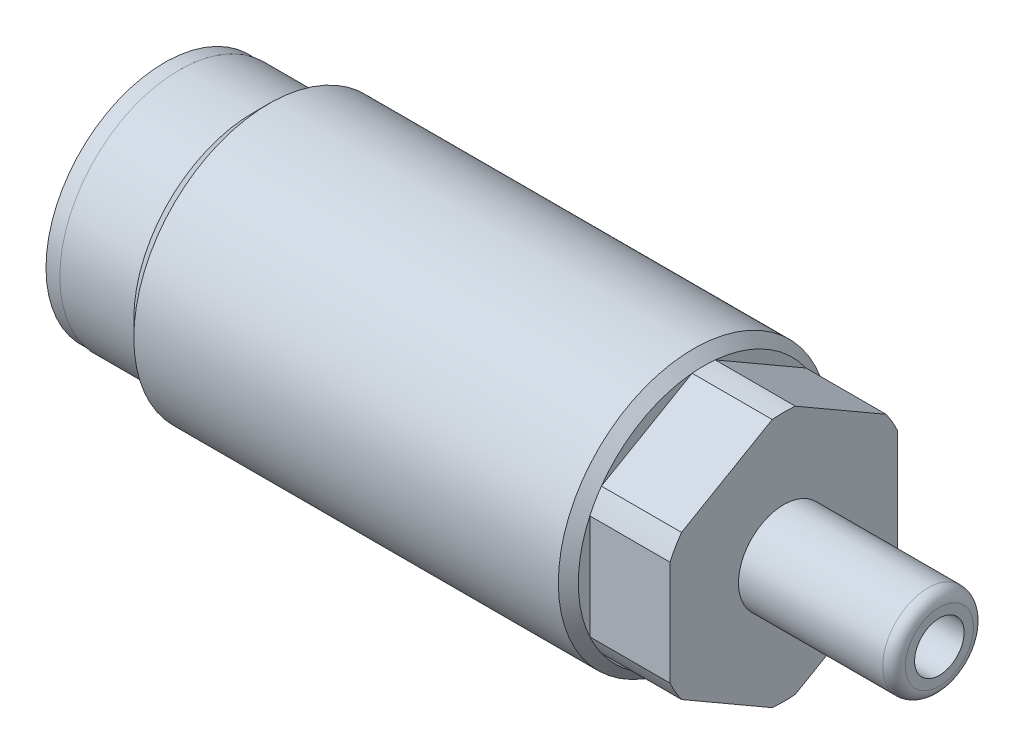
ISO-10303-21;
HEADER;
FILE_DESCRIPTION(('STEP AP214'),'2;1');
FILE_NAME('part.step','',(''),(''),'','','');
FILE_SCHEMA(('AUTOMOTIVE_DESIGN { 1 0 10303 214 1 1 1 1 }'));
ENDSEC;
DATA;
#1=APPLICATION_CONTEXT('core data for automotive mechanical design processes');
#2=APPLICATION_PROTOCOL_DEFINITION('international standard','automotive_design',2000,#1);
#3=PRODUCT_CONTEXT('',#1,'mechanical');
#4=PRODUCT('Part','Part','',(#3));
#5=PRODUCT_RELATED_PRODUCT_CATEGORY('part','',(#4));
#6=PRODUCT_DEFINITION_FORMATION('','',#4);
#7=PRODUCT_DEFINITION_CONTEXT('part definition',#1,'design');
#8=PRODUCT_DEFINITION('design','',#6,#7);
#9=PRODUCT_DEFINITION_SHAPE('','',#8);
#10=(LENGTH_UNIT() NAMED_UNIT(*) SI_UNIT(.MILLI.,.METRE.));
#11=(NAMED_UNIT(*) PLANE_ANGLE_UNIT() SI_UNIT($,.RADIAN.));
#12=(NAMED_UNIT(*) SI_UNIT($,.STERADIAN.) SOLID_ANGLE_UNIT());
#13=UNCERTAINTY_MEASURE_WITH_UNIT(LENGTH_MEASURE(1.E-05),#10,'distance_accuracy_value','');
#14=(GEOMETRIC_REPRESENTATION_CONTEXT(3) GLOBAL_UNCERTAINTY_ASSIGNED_CONTEXT((#13)) GLOBAL_UNIT_ASSIGNED_CONTEXT((#10,
#11,#12)) REPRESENTATION_CONTEXT('',''));
#15=CARTESIAN_POINT('',(0.,0.,0.));
#16=DIRECTION('',(0.,0.,1.));
#17=DIRECTION('',(1.,0.,0.));
#18=AXIS2_PLACEMENT_3D('',#15,#16,#17);
#19=CARTESIAN_POINT('',(0.,0.,0.));
#20=DIRECTION('',(1.,0.,0.));
#21=DIRECTION('',(0.,0.,-1.));
#22=AXIS2_PLACEMENT_3D('',#19,#20,#21);
#23=PLANE('',#22);
#24=CARTESIAN_POINT('',(0.,0.,0.));
#25=DIRECTION('',(-1.,0.,0.));
#26=DIRECTION('',(0.,0.,1.));
#27=AXIS2_PLACEMENT_3D('',#24,#25,#26);
#28=CIRCLE('',#27,8.3185);
#29=CARTESIAN_POINT('',(0.,0.,8.3185));
#30=VERTEX_POINT('',#29);
#31=EDGE_CURVE('E235',#30,#30,#28,.T.);
#32=ORIENTED_EDGE('',*,*,#31,.T.);
#33=EDGE_LOOP('',(#32));
#34=FACE_BOUND('',#33,.T.);
#35=CARTESIAN_POINT('',(0.,0.,0.));
#36=DIRECTION('',(1.,0.,0.));
#37=DIRECTION('',(0.,0.,-1.));
#38=AXIS2_PLACEMENT_3D('',#35,#36,#37);
#39=CIRCLE('',#38,8.2677);
#40=CARTESIAN_POINT('',(0.,0.,-8.2677));
#41=VERTEX_POINT('',#40);
#42=EDGE_CURVE('E48',#41,#41,#39,.F.);
#43=ORIENTED_EDGE('',*,*,#42,.F.);
#44=EDGE_LOOP('',(#43));
#45=FACE_BOUND('',#44,.T.);
#46=ADVANCED_FACE('F40',(#34,#45),#23,.F.);
#47=CARTESIAN_POINT('',(42.164,0.,0.));
#48=DIRECTION('',(-1.,0.,0.));
#49=DIRECTION('',(0.,0.,1.));
#50=AXIS2_PLACEMENT_3D('',#47,#48,#49);
#51=PLANE('',#50);
#52=CARTESIAN_POINT('',(42.164,0.,0.));
#53=DIRECTION('',(-1.,0.,0.));
#54=DIRECTION('',(0.,0.,1.));
#55=AXIS2_PLACEMENT_3D('',#52,#53,#54);
#56=CIRCLE('',#55,8.7376);
#57=CARTESIAN_POINT('',(42.164,-5.04775879575,7.13202530140833));
#58=VERTEX_POINT('',#57);
#59=CARTESIAN_POINT('',(42.164,-3.652635693578,7.9375));
#60=VERTEX_POINT('',#59);
#61=EDGE_CURVE('E223',#58,#60,#56,.T.);
#62=ORIENTED_EDGE('',*,*,#61,.F.);
#63=DIRECTION('',(0.,0.499999999999998,0.86602540378444));
#64=VECTOR('',#63,1.);
#65=CARTESIAN_POINT('',(42.164,-6.87407664253899,3.96874999999998));
#66=LINE('',#65,#64);
#67=CARTESIAN_POINT('',(42.164,-8.70039448932799,0.805474698591639));
#68=VERTEX_POINT('',#67);
#69=EDGE_CURVE('E139',#68,#58,#66,.T.);
#70=ORIENTED_EDGE('',*,*,#69,.F.);
#71=CARTESIAN_POINT('',(42.164,-8.70039448932798,-0.805474698591645));
#72=VERTEX_POINT('',#71);
#73=EDGE_CURVE('E421',#72,#68,#56,.T.);
#74=ORIENTED_EDGE('',*,*,#73,.F.);
#75=DIRECTION('',(0.,0.499999999999998,-0.86602540378444));
#76=VECTOR('',#75,1.);
#77=CARTESIAN_POINT('',(42.164,-6.87407664253899,-3.96874999999999));
#78=LINE('',#77,#76);
#79=CARTESIAN_POINT('',(42.164,-5.04775879575,-7.13202530140833));
#80=VERTEX_POINT('',#79);
#81=EDGE_CURVE('E155',#72,#80,#78,.T.);
#82=ORIENTED_EDGE('',*,*,#81,.T.);
#83=CARTESIAN_POINT('',(42.164,-3.65263569357799,-7.9375));
#84=VERTEX_POINT('',#83);
#85=EDGE_CURVE('E423',#84,#80,#56,.T.);
#86=ORIENTED_EDGE('',*,*,#85,.F.);
#87=DIRECTION('',(0.,-1.,0.));
#88=VECTOR('',#87,1.);
#89=CARTESIAN_POINT('',(42.164,0.,-7.9375));
#90=LINE('',#89,#88);
#91=CARTESIAN_POINT('',(42.164,3.652635693578,-7.9375));
#92=VERTEX_POINT('',#91);
#93=EDGE_CURVE('E165',#92,#84,#90,.T.);
#94=ORIENTED_EDGE('',*,*,#93,.F.);
#95=CARTESIAN_POINT('',(42.164,5.04775879575001,-7.13202530140832));
#96=VERTEX_POINT('',#95);
#97=EDGE_CURVE('E428',#96,#92,#56,.T.);
#98=ORIENTED_EDGE('',*,*,#97,.F.);
#99=DIRECTION('',(0.,-0.499999999999998,-0.86602540378444));
#100=VECTOR('',#99,1.);
#101=CARTESIAN_POINT('',(42.164,6.87407664253899,-3.96874999999998));
#102=LINE('',#101,#100);
#103=CARTESIAN_POINT('',(42.164,8.70039448932798,-0.805474698591648));
#104=VERTEX_POINT('',#103);
#105=EDGE_CURVE('E177',#104,#96,#102,.T.);
#106=ORIENTED_EDGE('',*,*,#105,.F.);
#107=CARTESIAN_POINT('',(42.164,8.70039448932798,0.805474698591648));
#108=VERTEX_POINT('',#107);
#109=EDGE_CURVE('E229',#108,#104,#56,.T.);
#110=ORIENTED_EDGE('',*,*,#109,.F.);
#111=DIRECTION('',(0.,-0.499999999999998,0.86602540378444));
#112=VECTOR('',#111,1.);
#113=CARTESIAN_POINT('',(42.164,6.87407664253899,3.96874999999998));
#114=LINE('',#113,#112);
#115=CARTESIAN_POINT('',(42.164,5.04775879575001,7.13202530140832));
#116=VERTEX_POINT('',#115);
#117=EDGE_CURVE('E188',#108,#116,#114,.T.);
#118=ORIENTED_EDGE('',*,*,#117,.T.);
#119=CARTESIAN_POINT('',(42.164,3.652635693578,7.9375));
#120=VERTEX_POINT('',#119);
#121=EDGE_CURVE('E225',#120,#116,#56,.T.);
#122=ORIENTED_EDGE('',*,*,#121,.F.);
#123=DIRECTION('',(0.,1.,0.));
#124=VECTOR('',#123,1.);
#125=CARTESIAN_POINT('',(42.164,0.,7.9375));
#126=LINE('',#125,#124);
#127=EDGE_CURVE('E200',#60,#120,#126,.T.);
#128=ORIENTED_EDGE('',*,*,#127,.F.);
#129=EDGE_LOOP('',(#62,#70,#74,#82,#86,#94,#98,#106,#110,#118,#122,#128));
#130=FACE_BOUND('',#129,.T.);
#131=CARTESIAN_POINT('',(42.164,0.,0.));
#132=DIRECTION('',(-1.,0.,0.));
#133=DIRECTION('',(0.,0.,1.));
#134=AXIS2_PLACEMENT_3D('',#131,#132,#133);
#135=CIRCLE('',#134,3.1623);
#136=CARTESIAN_POINT('',(42.164,0.,3.1623));
#137=VERTEX_POINT('',#136);
#138=EDGE_CURVE('E244',#137,#137,#135,.F.);
#139=ORIENTED_EDGE('',*,*,#138,.F.);
#140=EDGE_LOOP('',(#139));
#141=FACE_BOUND('',#140,.T.);
#142=ADVANCED_FACE('F258',(#130,#141),#51,.F.);
#143=CARTESIAN_POINT('',(-3.32735081986688,0.,0.));
#144=DIRECTION('',(-1.,0.,0.));
#145=DIRECTION('',(0.,0.,1.));
#146=AXIS2_PLACEMENT_3D('',#143,#144,#145);
#147=CYLINDRICAL_SURFACE('',#146,8.7376);
#148=DIRECTION('',(1.,0.,0.));
#149=VECTOR('',#148,1.);
#150=CARTESIAN_POINT('',(36.576,-8.70039448932799,0.805474698591639));
#151=LINE('',#150,#149);
#152=CARTESIAN_POINT('',(36.576,-8.70039448932799,0.805474698591639));
#153=VERTEX_POINT('',#152);
#154=EDGE_CURVE('E150',#153,#68,#151,.T.);
#155=ORIENTED_EDGE('',*,*,#154,.F.);
#156=CARTESIAN_POINT('',(36.576,0.,0.));
#157=DIRECTION('',(-1.,0.,0.));
#158=DIRECTION('',(0.,0.,1.));
#159=AXIS2_PLACEMENT_3D('',#156,#157,#158);
#160=CIRCLE('',#159,8.7376);
#161=CARTESIAN_POINT('',(36.576,-8.70039448932798,-0.805474698591632));
#162=VERTEX_POINT('',#161);
#163=EDGE_CURVE('E447',#162,#153,#160,.T.);
#164=ORIENTED_EDGE('',*,*,#163,.F.);
#165=DIRECTION('',(1.,0.,0.));
#166=VECTOR('',#165,1.);
#167=CARTESIAN_POINT('',(36.576,-8.70039448932798,-0.805474698591645));
#168=LINE('',#167,#166);
#169=EDGE_CURVE('E160',#162,#72,#168,.T.);
#170=ORIENTED_EDGE('',*,*,#169,.T.);
#171=ORIENTED_EDGE('',*,*,#73,.T.);
#172=EDGE_LOOP('',(#155,#164,#170,#171));
#173=FACE_BOUND('',#172,.T.);
#174=ADVANCED_FACE('F264',(#173),#147,.T.);
#175=DIRECTION('',(1.,0.,0.));
#176=VECTOR('',#175,1.);
#177=CARTESIAN_POINT('',(36.576,-5.04775879575,7.13202530140833));
#178=LINE('',#177,#176);
#179=CARTESIAN_POINT('',(36.576,-5.04775879575,7.13202530140832));
#180=VERTEX_POINT('',#179);
#181=EDGE_CURVE('E152',#180,#58,#178,.T.);
#182=ORIENTED_EDGE('',*,*,#181,.T.);
#183=ORIENTED_EDGE('',*,*,#61,.T.);
#184=DIRECTION('',(1.,0.,0.));
#185=VECTOR('',#184,1.);
#186=CARTESIAN_POINT('',(36.576,-3.652635693578,7.9375));
#187=LINE('',#186,#185);
#188=CARTESIAN_POINT('',(36.576,-3.652635693578,7.9375));
#189=VERTEX_POINT('',#188);
#190=EDGE_CURVE('E209',#189,#60,#187,.T.);
#191=ORIENTED_EDGE('',*,*,#190,.F.);
#192=EDGE_CURVE('E219',#180,#189,#160,.T.);
#193=ORIENTED_EDGE('',*,*,#192,.F.);
#194=EDGE_LOOP('',(#182,#183,#191,#193));
#195=FACE_BOUND('',#194,.T.);
#196=ADVANCED_FACE('F366',(#195),#147,.T.);
#197=ORIENTED_EDGE('',*,*,#85,.T.);
#198=DIRECTION('',(1.,0.,0.));
#199=VECTOR('',#198,1.);
#200=CARTESIAN_POINT('',(36.576,-5.04775879575,-7.13202530140833));
#201=LINE('',#200,#199);
#202=CARTESIAN_POINT('',(36.576,-5.04775879575,-7.13202530140833));
#203=VERTEX_POINT('',#202);
#204=EDGE_CURVE('E163',#203,#80,#201,.T.);
#205=ORIENTED_EDGE('',*,*,#204,.F.);
#206=CARTESIAN_POINT('',(36.576,-3.65263569357799,-7.9375));
#207=VERTEX_POINT('',#206);
#208=EDGE_CURVE('E444',#207,#203,#160,.T.);
#209=ORIENTED_EDGE('',*,*,#208,.F.);
#210=DIRECTION('',(1.,0.,0.));
#211=VECTOR('',#210,1.);
#212=CARTESIAN_POINT('',(36.576,-3.65263569357799,-7.9375));
#213=LINE('',#212,#211);
#214=EDGE_CURVE('E174',#207,#84,#213,.T.);
#215=ORIENTED_EDGE('',*,*,#214,.T.);
#216=EDGE_LOOP('',(#197,#205,#209,#215));
#217=FACE_BOUND('',#216,.T.);
#218=ADVANCED_FACE('F369',(#217),#147,.T.);
#219=DIRECTION('',(1.,0.,0.));
#220=VECTOR('',#219,1.);
#221=CARTESIAN_POINT('',(36.576,3.652635693578,-7.9375));
#222=LINE('',#221,#220);
#223=CARTESIAN_POINT('',(36.576,3.652635693578,-7.9375));
#224=VERTEX_POINT('',#223);
#225=EDGE_CURVE('E172',#224,#92,#222,.T.);
#226=ORIENTED_EDGE('',*,*,#225,.F.);
#227=CARTESIAN_POINT('',(36.576,5.04775879575001,-7.13202530140832));
#228=VERTEX_POINT('',#227);
#229=EDGE_CURVE('E414',#228,#224,#160,.T.);
#230=ORIENTED_EDGE('',*,*,#229,.F.);
#231=DIRECTION('',(1.,0.,0.));
#232=VECTOR('',#231,1.);
#233=CARTESIAN_POINT('',(36.576,5.04775879575001,-7.13202530140832));
#234=LINE('',#233,#232);
#235=EDGE_CURVE('E185',#228,#96,#234,.T.);
#236=ORIENTED_EDGE('',*,*,#235,.T.);
#237=ORIENTED_EDGE('',*,*,#97,.T.);
#238=EDGE_LOOP('',(#226,#230,#236,#237));
#239=FACE_BOUND('',#238,.T.);
#240=ADVANCED_FACE('F397',(#239),#147,.T.);
#241=DIRECTION('',(1.,0.,0.));
#242=VECTOR('',#241,1.);
#243=CARTESIAN_POINT('',(36.576,8.70039448932798,-0.805474698591648));
#244=LINE('',#243,#242);
#245=CARTESIAN_POINT('',(36.576,8.70039448932798,-0.805474698591648));
#246=VERTEX_POINT('',#245);
#247=EDGE_CURVE('E183',#246,#104,#244,.T.);
#248=ORIENTED_EDGE('',*,*,#247,.F.);
#249=CARTESIAN_POINT('',(36.576,8.70039448932798,0.805474698591648));
#250=VERTEX_POINT('',#249);
#251=EDGE_CURVE('E224',#250,#246,#160,.T.);
#252=ORIENTED_EDGE('',*,*,#251,.F.);
#253=DIRECTION('',(1.,0.,0.));
#254=VECTOR('',#253,1.);
#255=CARTESIAN_POINT('',(36.576,8.70039448932798,0.805474698591648));
#256=LINE('',#255,#254);
#257=EDGE_CURVE('E195',#250,#108,#256,.T.);
#258=ORIENTED_EDGE('',*,*,#257,.T.);
#259=ORIENTED_EDGE('',*,*,#109,.T.);
#260=EDGE_LOOP('',(#248,#252,#258,#259));
#261=FACE_BOUND('',#260,.T.);
#262=ADVANCED_FACE('F384',(#261),#147,.T.);
#263=ORIENTED_EDGE('',*,*,#121,.T.);
#264=DIRECTION('',(1.,0.,0.));
#265=VECTOR('',#264,1.);
#266=CARTESIAN_POINT('',(36.576,5.04775879575001,7.13202530140832));
#267=LINE('',#266,#265);
#268=CARTESIAN_POINT('',(36.576,5.04775879575001,7.13202530140832));
#269=VERTEX_POINT('',#268);
#270=EDGE_CURVE('E198',#269,#116,#267,.T.);
#271=ORIENTED_EDGE('',*,*,#270,.F.);
#272=CARTESIAN_POINT('',(36.576,3.652635693578,7.9375));
#273=VERTEX_POINT('',#272);
#274=EDGE_CURVE('E220',#273,#269,#160,.T.);
#275=ORIENTED_EDGE('',*,*,#274,.F.);
#276=DIRECTION('',(1.,0.,0.));
#277=VECTOR('',#276,1.);
#278=CARTESIAN_POINT('',(36.576,3.652635693578,7.9375));
#279=LINE('',#278,#277);
#280=EDGE_CURVE('E211',#273,#120,#279,.T.);
#281=ORIENTED_EDGE('',*,*,#280,.T.);
#282=EDGE_LOOP('',(#263,#271,#275,#281));
#283=FACE_BOUND('',#282,.T.);
#284=ADVANCED_FACE('F371',(#283),#147,.T.);
#285=CARTESIAN_POINT('',(-25.954653294511,0.,0.));
#286=DIRECTION('',(-1.,0.,0.));
#287=DIRECTION('',(0.,0.,1.));
#288=AXIS2_PLACEMENT_3D('',#285,#286,#287);
#289=CYLINDRICAL_SURFACE('',#288,9.4361);
#290=CARTESIAN_POINT('',(6.27380000000001,0.,0.));
#291=DIRECTION('',(-1.,0.,0.));
#292=DIRECTION('',(0.,0.,1.));
#293=AXIS2_PLACEMENT_3D('',#290,#291,#292);
#294=CIRCLE('',#293,9.4361);
#295=CARTESIAN_POINT('',(6.27380000000001,0.,9.4361));
#296=VERTEX_POINT('',#295);
#297=EDGE_CURVE('E228',#296,#296,#294,.T.);
#298=ORIENTED_EDGE('',*,*,#297,.F.);
#299=EDGE_LOOP('',(#298));
#300=FACE_BOUND('',#299,.T.);
#301=CARTESIAN_POINT('',(35.8775,0.,0.));
#302=DIRECTION('',(-1.,0.,0.));
#303=DIRECTION('',(0.,0.,1.));
#304=AXIS2_PLACEMENT_3D('',#301,#302,#303);
#305=CIRCLE('',#304,9.4361);
#306=CARTESIAN_POINT('',(35.8775,0.,9.4361));
#307=VERTEX_POINT('',#306);
#308=EDGE_CURVE('E214',#307,#307,#305,.T.);
#309=ORIENTED_EDGE('',*,*,#308,.T.);
#310=EDGE_LOOP('',(#309));
#311=FACE_BOUND('',#310,.T.);
#312=ADVANCED_FACE('F377',(#300,#311),#289,.T.);
#313=CARTESIAN_POINT('',(-2.14655754787169,0.,0.));
#314=DIRECTION('',(-1.,0.,0.));
#315=DIRECTION('',(0.,0.,1.));
#316=AXIS2_PLACEMENT_3D('',#313,#314,#315);
#317=CYLINDRICAL_SURFACE('',#316,8.3185);
#318=CARTESIAN_POINT('',(5.1562,0.,0.));
#319=DIRECTION('',(-1.,0.,0.));
#320=DIRECTION('',(0.,0.,1.));
#321=AXIS2_PLACEMENT_3D('',#318,#319,#320);
#322=CIRCLE('',#321,8.3185);
#323=CARTESIAN_POINT('',(5.1562,0.,8.3185));
#324=VERTEX_POINT('',#323);
#325=EDGE_CURVE('E232',#324,#324,#322,.T.);
#326=ORIENTED_EDGE('',*,*,#325,.T.);
#327=EDGE_LOOP('',(#326));
#328=FACE_BOUND('',#327,.T.);
#329=ORIENTED_EDGE('',*,*,#31,.F.);
#330=EDGE_LOOP('',(#329));
#331=FACE_BOUND('',#330,.T.);
#332=ADVANCED_FACE('F374',(#328,#331),#317,.T.);
#333=CARTESIAN_POINT('',(5.1562,0.,0.));
#334=DIRECTION('',(1.,0.,0.));
#335=DIRECTION('',(0.,0.,-1.));
#336=AXIS2_PLACEMENT_3D('',#333,#334,#335);
#337=CONICAL_SURFACE('',#336,8.3185,0.785398163397443);
#338=ORIENTED_EDGE('',*,*,#297,.T.);
#339=EDGE_LOOP('',(#338));
#340=FACE_BOUND('',#339,.T.);
#341=ORIENTED_EDGE('',*,*,#325,.F.);
#342=EDGE_LOOP('',(#341));
#343=FACE_BOUND('',#342,.T.);
#344=ADVANCED_FACE('F364',(#340,#343),#337,.T.);
#345=CARTESIAN_POINT('',(35.8775,0.,0.));
#346=DIRECTION('',(-1.,0.,0.));
#347=DIRECTION('',(0.,0.,1.));
#348=AXIS2_PLACEMENT_3D('',#345,#346,#347);
#349=CONICAL_SURFACE('',#348,9.4361,0.785398163397445);
#350=ORIENTED_EDGE('',*,*,#274,.T.);
#351=CARTESIAN_POINT('',(36.576,0.,0.));
#352=DIRECTION('',(1.,0.,0.));
#353=DIRECTION('',(0.,0.,-1.));
#354=AXIS2_PLACEMENT_3D('',#351,#352,#353);
#355=CIRCLE('',#354,8.7376);
#356=EDGE_CURVE('E192',#250,#269,#355,.T.);
#357=ORIENTED_EDGE('',*,*,#356,.F.);
#358=ORIENTED_EDGE('',*,*,#251,.T.);
#359=CARTESIAN_POINT('',(36.576,0.,0.));
#360=DIRECTION('',(1.,0.,0.));
#361=DIRECTION('',(0.,0.,-1.));
#362=AXIS2_PLACEMENT_3D('',#359,#360,#361);
#363=CIRCLE('',#362,8.7376);
#364=EDGE_CURVE('E179',#228,#246,#363,.T.);
#365=ORIENTED_EDGE('',*,*,#364,.F.);
#366=ORIENTED_EDGE('',*,*,#229,.T.);
#367=CARTESIAN_POINT('',(36.576,0.,0.));
#368=DIRECTION('',(1.,0.,0.));
#369=DIRECTION('',(0.,0.,-1.));
#370=AXIS2_PLACEMENT_3D('',#367,#368,#369);
#371=CIRCLE('',#370,8.7376);
#372=EDGE_CURVE('E168',#207,#224,#371,.T.);
#373=ORIENTED_EDGE('',*,*,#372,.F.);
#374=ORIENTED_EDGE('',*,*,#208,.T.);
#375=CARTESIAN_POINT('',(36.576,0.,0.));
#376=DIRECTION('',(1.,0.,0.));
#377=DIRECTION('',(0.,0.,-1.));
#378=AXIS2_PLACEMENT_3D('',#375,#376,#377);
#379=CIRCLE('',#378,8.7376);
#380=EDGE_CURVE('E158',#162,#203,#379,.T.);
#381=ORIENTED_EDGE('',*,*,#380,.F.);
#382=ORIENTED_EDGE('',*,*,#163,.T.);
#383=CARTESIAN_POINT('',(36.576,0.,0.));
#384=DIRECTION('',(1.,0.,0.));
#385=DIRECTION('',(0.,0.,-1.));
#386=AXIS2_PLACEMENT_3D('',#383,#384,#385);
#387=CIRCLE('',#386,8.7376);
#388=EDGE_CURVE('E142',#180,#153,#387,.T.);
#389=ORIENTED_EDGE('',*,*,#388,.F.);
#390=ORIENTED_EDGE('',*,*,#192,.T.);
#391=CARTESIAN_POINT('',(36.576,0.,0.));
#392=DIRECTION('',(1.,0.,0.));
#393=DIRECTION('',(0.,0.,-1.));
#394=AXIS2_PLACEMENT_3D('',#391,#392,#393);
#395=CIRCLE('',#394,8.7376);
#396=EDGE_CURVE('E203',#273,#189,#395,.T.);
#397=ORIENTED_EDGE('',*,*,#396,.F.);
#398=EDGE_LOOP('',(#350,#357,#358,#365,#366,#373,#374,#381,#382,#389,#390,#397));
#399=FACE_BOUND('',#398,.T.);
#400=ORIENTED_EDGE('',*,*,#308,.F.);
#401=EDGE_LOOP('',(#400));
#402=FACE_BOUND('',#401,.T.);
#403=ADVANCED_FACE('F360',(#399,#402),#349,.T.);
#404=CARTESIAN_POINT('',(36.576,0.,7.9375));
#405=DIRECTION('',(0.,0.,-1.));
#406=DIRECTION('',(-1.,0.,0.));
#407=AXIS2_PLACEMENT_3D('',#404,#405,#406);
#408=PLANE('',#407);
#409=ORIENTED_EDGE('',*,*,#127,.T.);
#410=ORIENTED_EDGE('',*,*,#280,.F.);
#411=DIRECTION('',(0.,1.,0.));
#412=VECTOR('',#411,1.);
#413=CARTESIAN_POINT('',(36.576,0.,7.9375));
#414=LINE('',#413,#412);
#415=EDGE_CURVE('E206',#189,#273,#414,.T.);
#416=ORIENTED_EDGE('',*,*,#415,.F.);
#417=ORIENTED_EDGE('',*,*,#190,.T.);
#418=EDGE_LOOP('',(#409,#410,#416,#417));
#419=FACE_BOUND('',#418,.T.);
#420=ADVANCED_FACE('F356',(#419),#408,.F.);
#421=CARTESIAN_POINT('',(36.576,0.,0.));
#422=DIRECTION('',(1.,0.,0.));
#423=DIRECTION('',(0.,0.,-1.));
#424=AXIS2_PLACEMENT_3D('',#421,#422,#423);
#425=PLANE('',#424);
#426=ORIENTED_EDGE('',*,*,#396,.T.);
#427=ORIENTED_EDGE('',*,*,#415,.T.);
#428=EDGE_LOOP('',(#426,#427));
#429=FACE_BOUND('',#428,.T.);
#430=ADVANCED_FACE('F352',(#429),#425,.T.);
#431=CARTESIAN_POINT('',(36.576,6.87407664253899,3.96874999999998));
#432=DIRECTION('',(0.,0.86602540378444,0.499999999999998));
#433=DIRECTION('',(0.,-0.499999999999998,0.86602540378444));
#434=AXIS2_PLACEMENT_3D('',#431,#432,#433);
#435=PLANE('',#434);
#436=ORIENTED_EDGE('',*,*,#117,.F.);
#437=ORIENTED_EDGE('',*,*,#257,.F.);
#438=DIRECTION('',(0.,-0.499999999999998,0.86602540378444));
#439=VECTOR('',#438,1.);
#440=CARTESIAN_POINT('',(36.576,6.87407664253899,3.96874999999998));
#441=LINE('',#440,#439);
#442=EDGE_CURVE('E190',#250,#269,#441,.T.);
#443=ORIENTED_EDGE('',*,*,#442,.T.);
#444=ORIENTED_EDGE('',*,*,#270,.T.);
#445=EDGE_LOOP('',(#436,#437,#443,#444));
#446=FACE_BOUND('',#445,.T.);
#447=ADVANCED_FACE('F348',(#446),#435,.T.);
#448=CARTESIAN_POINT('',(36.576,0.,0.));
#449=DIRECTION('',(1.,0.,0.));
#450=DIRECTION('',(0.,0.,-1.));
#451=AXIS2_PLACEMENT_3D('',#448,#449,#450);
#452=PLANE('',#451);
#453=ORIENTED_EDGE('',*,*,#442,.F.);
#454=ORIENTED_EDGE('',*,*,#356,.T.);
#455=EDGE_LOOP('',(#453,#454));
#456=FACE_BOUND('',#455,.T.);
#457=ADVANCED_FACE('F344',(#456),#452,.T.);
#458=CARTESIAN_POINT('',(36.576,6.87407664253899,-3.96874999999998));
#459=DIRECTION('',(0.,-0.86602540378444,0.499999999999998));
#460=DIRECTION('',(0.,-0.499999999999998,-0.86602540378444));
#461=AXIS2_PLACEMENT_3D('',#458,#459,#460);
#462=PLANE('',#461);
#463=ORIENTED_EDGE('',*,*,#105,.T.);
#464=ORIENTED_EDGE('',*,*,#235,.F.);
#465=DIRECTION('',(0.,-0.499999999999998,-0.86602540378444));
#466=VECTOR('',#465,1.);
#467=CARTESIAN_POINT('',(36.576,6.87407664253899,-3.96874999999998));
#468=LINE('',#467,#466);
#469=EDGE_CURVE('E181',#246,#228,#468,.T.);
#470=ORIENTED_EDGE('',*,*,#469,.F.);
#471=ORIENTED_EDGE('',*,*,#247,.T.);
#472=EDGE_LOOP('',(#463,#464,#470,#471));
#473=FACE_BOUND('',#472,.T.);
#474=ADVANCED_FACE('F340',(#473),#462,.F.);
#475=CARTESIAN_POINT('',(36.576,0.,0.));
#476=DIRECTION('',(1.,0.,0.));
#477=DIRECTION('',(0.,0.,-1.));
#478=AXIS2_PLACEMENT_3D('',#475,#476,#477);
#479=PLANE('',#478);
#480=ORIENTED_EDGE('',*,*,#364,.T.);
#481=ORIENTED_EDGE('',*,*,#469,.T.);
#482=EDGE_LOOP('',(#480,#481));
#483=FACE_BOUND('',#482,.T.);
#484=ADVANCED_FACE('F336',(#483),#479,.T.);
#485=CARTESIAN_POINT('',(36.576,0.,-7.9375));
#486=DIRECTION('',(0.,0.,1.));
#487=DIRECTION('',(0.,-1.,0.));
#488=AXIS2_PLACEMENT_3D('',#485,#486,#487);
#489=PLANE('',#488);
#490=ORIENTED_EDGE('',*,*,#93,.T.);
#491=ORIENTED_EDGE('',*,*,#214,.F.);
#492=DIRECTION('',(0.,-1.,0.));
#493=VECTOR('',#492,1.);
#494=CARTESIAN_POINT('',(36.576,0.,-7.9375));
#495=LINE('',#494,#493);
#496=EDGE_CURVE('E170',#224,#207,#495,.T.);
#497=ORIENTED_EDGE('',*,*,#496,.F.);
#498=ORIENTED_EDGE('',*,*,#225,.T.);
#499=EDGE_LOOP('',(#490,#491,#497,#498));
#500=FACE_BOUND('',#499,.T.);
#501=ADVANCED_FACE('F332',(#500),#489,.F.);
#502=CARTESIAN_POINT('',(36.576,0.,0.));
#503=DIRECTION('',(1.,0.,0.));
#504=DIRECTION('',(0.,0.,-1.));
#505=AXIS2_PLACEMENT_3D('',#502,#503,#504);
#506=PLANE('',#505);
#507=ORIENTED_EDGE('',*,*,#372,.T.);
#508=ORIENTED_EDGE('',*,*,#496,.T.);
#509=EDGE_LOOP('',(#507,#508));
#510=FACE_BOUND('',#509,.T.);
#511=ADVANCED_FACE('F328',(#510),#506,.T.);
#512=CARTESIAN_POINT('',(36.576,-6.87407664253899,-3.96874999999999));
#513=DIRECTION('',(0.,-0.86602540378444,-0.499999999999998));
#514=DIRECTION('',(0.,0.499999999999998,-0.86602540378444));
#515=AXIS2_PLACEMENT_3D('',#512,#513,#514);
#516=PLANE('',#515);
#517=ORIENTED_EDGE('',*,*,#81,.F.);
#518=ORIENTED_EDGE('',*,*,#169,.F.);
#519=DIRECTION('',(0.,0.499999999999998,-0.86602540378444));
#520=VECTOR('',#519,1.);
#521=CARTESIAN_POINT('',(36.576,-6.87407664253899,-3.96874999999999));
#522=LINE('',#521,#520);
#523=EDGE_CURVE('E61',#162,#203,#522,.T.);
#524=ORIENTED_EDGE('',*,*,#523,.T.);
#525=ORIENTED_EDGE('',*,*,#204,.T.);
#526=EDGE_LOOP('',(#517,#518,#524,#525));
#527=FACE_BOUND('',#526,.T.);
#528=ADVANCED_FACE('F325',(#527),#516,.T.);
#529=CARTESIAN_POINT('',(36.576,0.,0.));
#530=DIRECTION('',(1.,0.,0.));
#531=DIRECTION('',(0.,0.,-1.));
#532=AXIS2_PLACEMENT_3D('',#529,#530,#531);
#533=PLANE('',#532);
#534=ORIENTED_EDGE('',*,*,#523,.F.);
#535=ORIENTED_EDGE('',*,*,#380,.T.);
#536=EDGE_LOOP('',(#534,#535));
#537=FACE_BOUND('',#536,.T.);
#538=ADVANCED_FACE('F321',(#537),#533,.T.);
#539=CARTESIAN_POINT('',(36.576,-6.87407664253899,3.96874999999998));
#540=DIRECTION('',(0.,0.86602540378444,-0.499999999999998));
#541=DIRECTION('',(0.,0.499999999999998,0.86602540378444));
#542=AXIS2_PLACEMENT_3D('',#539,#540,#541);
#543=PLANE('',#542);
#544=ORIENTED_EDGE('',*,*,#69,.T.);
#545=ORIENTED_EDGE('',*,*,#181,.F.);
#546=DIRECTION('',(0.,0.499999999999998,0.86602540378444));
#547=VECTOR('',#546,1.);
#548=CARTESIAN_POINT('',(36.576,-6.87407664253899,3.96874999999998));
#549=LINE('',#548,#547);
#550=EDGE_CURVE('E54',#153,#180,#549,.T.);
#551=ORIENTED_EDGE('',*,*,#550,.F.);
#552=ORIENTED_EDGE('',*,*,#154,.T.);
#553=EDGE_LOOP('',(#544,#545,#551,#552));
#554=FACE_BOUND('',#553,.T.);
#555=ADVANCED_FACE('F318',(#554),#543,.F.);
#556=CARTESIAN_POINT('',(36.576,0.,0.));
#557=DIRECTION('',(1.,0.,0.));
#558=DIRECTION('',(0.,0.,-1.));
#559=AXIS2_PLACEMENT_3D('',#556,#557,#558);
#560=PLANE('',#559);
#561=ORIENTED_EDGE('',*,*,#388,.T.);
#562=ORIENTED_EDGE('',*,*,#550,.T.);
#563=EDGE_LOOP('',(#561,#562));
#564=FACE_BOUND('',#563,.T.);
#565=ADVANCED_FACE('F314',(#564),#560,.T.);
#566=CARTESIAN_POINT('',(-1.69109563516832,0.,0.));
#567=DIRECTION('',(-1.,0.,0.));
#568=DIRECTION('',(0.,0.,1.));
#569=AXIS2_PLACEMENT_3D('',#566,#567,#568);
#570=CYLINDRICAL_SURFACE('',#569,3.1623);
#571=CARTESIAN_POINT('',(52.2224,0.,0.));
#572=DIRECTION('',(-1.,0.,0.));
#573=DIRECTION('',(0.,0.,1.));
#574=AXIS2_PLACEMENT_3D('',#571,#572,#573);
#575=CIRCLE('',#574,3.1623);
#576=CARTESIAN_POINT('',(52.2224,0.,3.1623));
#577=VERTEX_POINT('',#576);
#578=EDGE_CURVE('E247',#577,#577,#575,.T.);
#579=ORIENTED_EDGE('',*,*,#578,.T.);
#580=EDGE_LOOP('',(#579));
#581=FACE_BOUND('',#580,.T.);
#582=ORIENTED_EDGE('',*,*,#138,.T.);
#583=EDGE_LOOP('',(#582));
#584=FACE_BOUND('',#583,.T.);
#585=ADVANCED_FACE('F310',(#581,#584),#570,.T.);
#586=CARTESIAN_POINT('',(53.0098,0.,0.));
#587=DIRECTION('',(-1.,0.,0.));
#588=DIRECTION('',(0.,0.,1.));
#589=AXIS2_PLACEMENT_3D('',#586,#587,#588);
#590=PLANE('',#589);
#591=CARTESIAN_POINT('',(53.0098,0.,0.));
#592=DIRECTION('',(1.,0.,0.));
#593=DIRECTION('',(0.,0.,-1.));
#594=AXIS2_PLACEMENT_3D('',#591,#592,#593);
#595=CIRCLE('',#594,1.7272);
#596=CARTESIAN_POINT('',(53.0098,0.,-1.7272));
#597=VERTEX_POINT('',#596);
#598=EDGE_CURVE('E140',#597,#597,#595,.T.);
#599=ORIENTED_EDGE('',*,*,#598,.F.);
#600=EDGE_LOOP('',(#599));
#601=FACE_BOUND('',#600,.T.);
#602=CARTESIAN_POINT('',(53.0098,0.,0.));
#603=DIRECTION('',(-1.,0.,0.));
#604=DIRECTION('',(0.,0.,1.));
#605=AXIS2_PLACEMENT_3D('',#602,#603,#604);
#606=CIRCLE('',#605,2.3749);
#607=CARTESIAN_POINT('',(53.0098,0.,2.3749));
#608=VERTEX_POINT('',#607);
#609=EDGE_CURVE('E250',#608,#608,#606,.F.);
#610=ORIENTED_EDGE('',*,*,#609,.T.);
#611=EDGE_LOOP('',(#610));
#612=FACE_BOUND('',#611,.T.);
#613=ADVANCED_FACE('F307',(#601,#612),#590,.F.);
#614=CARTESIAN_POINT('',(52.2224,0.,0.));
#615=DIRECTION('',(-1.,0.,0.));
#616=DIRECTION('',(0.,0.,1.));
#617=AXIS2_PLACEMENT_3D('',#614,#615,#616);
#618=TOROIDAL_SURFACE('',#617,2.3749,0.7874);
#619=ORIENTED_EDGE('',*,*,#609,.F.);
#620=EDGE_LOOP('',(#619));
#621=FACE_BOUND('',#620,.T.);
#622=ORIENTED_EDGE('',*,*,#578,.F.);
#623=EDGE_LOOP('',(#622));
#624=FACE_BOUND('',#623,.T.);
#625=ADVANCED_FACE('F42',(#621,#624),#618,.T.);
#626=CARTESIAN_POINT('',(42.3418,0.,0.));
#627=DIRECTION('',(1.,0.,0.));
#628=DIRECTION('',(0.,0.,-1.));
#629=AXIS2_PLACEMENT_3D('',#626,#627,#628);
#630=CONICAL_SURFACE('',#629,1.7272,1.02974425867665);
#631=CARTESIAN_POINT('',(41.3039935388156,0.,0.));
#632=VERTEX_POINT('',#631);
#633=VERTEX_LOOP('',#632);
#634=FACE_BOUND('',#633,.T.);
#635=CARTESIAN_POINT('',(42.3418,0.,0.));
#636=DIRECTION('',(1.,0.,0.));
#637=DIRECTION('',(0.,0.,-1.));
#638=AXIS2_PLACEMENT_3D('',#635,#636,#637);
#639=CIRCLE('',#638,1.7272);
#640=CARTESIAN_POINT('',(42.3418,0.,-1.7272));
#641=VERTEX_POINT('',#640);
#642=EDGE_CURVE('E137',#641,#641,#639,.T.);
#643=ORIENTED_EDGE('',*,*,#642,.T.);
#644=EDGE_LOOP('',(#643));
#645=FACE_BOUND('',#644,.T.);
#646=ADVANCED_FACE('F130',(#634,#645),#630,.F.);
#647=CARTESIAN_POINT('',(53.0098,0.,0.));
#648=DIRECTION('',(1.,0.,0.));
#649=DIRECTION('',(0.,0.,-1.));
#650=AXIS2_PLACEMENT_3D('',#647,#648,#649);
#651=CYLINDRICAL_SURFACE('',#650,1.7272);
#652=ORIENTED_EDGE('',*,*,#642,.F.);
#653=EDGE_LOOP('',(#652));
#654=FACE_BOUND('',#653,.T.);
#655=ORIENTED_EDGE('',*,*,#598,.T.);
#656=EDGE_LOOP('',(#655));
#657=FACE_BOUND('',#656,.T.);
#658=ADVANCED_FACE('F133',(#654,#657),#651,.F.);
#659=CARTESIAN_POINT('',(-4.80711058115521,0.,0.));
#660=DIRECTION('',(-1.,0.,0.));
#661=DIRECTION('',(0.,0.,1.));
#662=AXIS2_PLACEMENT_3D('',#659,#660,#661);
#663=CYLINDRICAL_SURFACE('',#662,5.7404);
#664=CARTESIAN_POINT('',(0.,0.,0.));
#665=DIRECTION('',(1.,0.,0.));
#666=DIRECTION('',(0.,0.,-1.));
#667=AXIS2_PLACEMENT_3D('',#664,#665,#666);
#668=CIRCLE('',#667,5.7404);
#669=CARTESIAN_POINT('',(0.,0.,-5.7404));
#670=VERTEX_POINT('',#669);
#671=EDGE_CURVE('E11',#670,#670,#668,.T.);
#672=ORIENTED_EDGE('',*,*,#671,.T.);
#673=EDGE_LOOP('',(#672));
#674=FACE_BOUND('',#673,.T.);
#675=CARTESIAN_POINT('',(-1.016,0.,0.));
#676=DIRECTION('',(-1.,0.,0.));
#677=DIRECTION('',(0.,0.,1.));
#678=AXIS2_PLACEMENT_3D('',#675,#676,#677);
#679=CIRCLE('',#678,5.7404);
#680=CARTESIAN_POINT('',(-1.016,0.,5.7404));
#681=VERTEX_POINT('',#680);
#682=EDGE_CURVE('E145',#681,#681,#679,.T.);
#683=ORIENTED_EDGE('',*,*,#682,.T.);
#684=EDGE_LOOP('',(#683));
#685=FACE_BOUND('',#684,.T.);
#686=ADVANCED_FACE('F281',(#674,#685),#663,.F.);
#687=CARTESIAN_POINT('',(-1.016,8.2677,0.));
#688=DIRECTION('',(1.,0.,0.));
#689=DIRECTION('',(0.,0.,-1.));
#690=AXIS2_PLACEMENT_3D('',#687,#688,#689);
#691=PLANE('',#690);
#692=ORIENTED_EDGE('',*,*,#682,.F.);
#693=EDGE_LOOP('',(#692));
#694=FACE_BOUND('',#693,.T.);
#695=CARTESIAN_POINT('',(-1.016,0.,0.));
#696=DIRECTION('',(-1.,0.,0.));
#697=DIRECTION('',(0.,0.,1.));
#698=AXIS2_PLACEMENT_3D('',#695,#696,#697);
#699=CIRCLE('',#698,8.2677);
#700=CARTESIAN_POINT('',(-1.016,0.,8.2677));
#701=VERTEX_POINT('',#700);
#702=EDGE_CURVE('E289',#701,#701,#699,.T.);
#703=ORIENTED_EDGE('',*,*,#702,.T.);
#704=EDGE_LOOP('',(#703));
#705=FACE_BOUND('',#704,.T.);
#706=ADVANCED_FACE('F284',(#694,#705),#691,.F.);
#707=CARTESIAN_POINT('',(-4.80711058115521,0.,0.));
#708=DIRECTION('',(-1.,0.,0.));
#709=DIRECTION('',(0.,0.,1.));
#710=AXIS2_PLACEMENT_3D('',#707,#708,#709);
#711=CYLINDRICAL_SURFACE('',#710,8.2677);
#712=ORIENTED_EDGE('',*,*,#702,.F.);
#713=EDGE_LOOP('',(#712));
#714=FACE_BOUND('',#713,.T.);
#715=ORIENTED_EDGE('',*,*,#42,.T.);
#716=EDGE_LOOP('',(#715));
#717=FACE_BOUND('',#716,.T.);
#718=ADVANCED_FACE('F255',(#714,#717),#711,.T.);
#719=CARTESIAN_POINT('',(1.016,0.,0.));
#720=DIRECTION('',(-1.,0.,0.));
#721=DIRECTION('',(0.,0.,1.));
#722=AXIS2_PLACEMENT_3D('',#719,#720,#721);
#723=PLANE('',#722);
#724=CARTESIAN_POINT('',(1.016,0.,0.));
#725=DIRECTION('',(-1.,0.,0.));
#726=DIRECTION('',(0.,0.,1.));
#727=AXIS2_PLACEMENT_3D('',#724,#725,#726);
#728=CIRCLE('',#727,3.9624);
#729=CARTESIAN_POINT('',(1.016,0.,3.9624));
#730=VERTEX_POINT('',#729);
#731=EDGE_CURVE('E238',#730,#730,#728,.T.);
#732=ORIENTED_EDGE('',*,*,#731,.T.);
#733=EDGE_LOOP('',(#732));
#734=FACE_BOUND('',#733,.T.);
#735=ADVANCED_FACE('F274',(#734),#723,.T.);
#736=CARTESIAN_POINT('',(-4.42386711138852,0.,0.));
#737=DIRECTION('',(-1.,0.,0.));
#738=DIRECTION('',(0.,0.,1.));
#739=AXIS2_PLACEMENT_3D('',#736,#737,#738);
#740=CYLINDRICAL_SURFACE('',#739,3.9624);
#741=CARTESIAN_POINT('',(0.,0.,0.));
#742=DIRECTION('',(-1.,0.,0.));
#743=DIRECTION('',(0.,0.,1.));
#744=AXIS2_PLACEMENT_3D('',#741,#742,#743);
#745=CIRCLE('',#744,3.9624);
#746=CARTESIAN_POINT('',(0.,0.,3.9624));
#747=VERTEX_POINT('',#746);
#748=EDGE_CURVE('E241',#747,#747,#745,.T.);
#749=ORIENTED_EDGE('',*,*,#748,.T.);
#750=EDGE_LOOP('',(#749));
#751=FACE_BOUND('',#750,.T.);
#752=ORIENTED_EDGE('',*,*,#731,.F.);
#753=EDGE_LOOP('',(#752));
#754=FACE_BOUND('',#753,.T.);
#755=ADVANCED_FACE('F269',(#751,#754),#740,.F.);
#756=ORIENTED_EDGE('',*,*,#748,.F.);
#757=EDGE_LOOP('',(#756));
#758=FACE_BOUND('',#757,.T.);
#759=ORIENTED_EDGE('',*,*,#671,.F.);
#760=EDGE_LOOP('',(#759));
#761=FACE_BOUND('',#760,.T.);
#762=ADVANCED_FACE('F260',(#758,#761),#23,.F.);
#763=CLOSED_SHELL('',(#46,#142,#174,#196,#218,#240,#262,#284,#312,#332,#344,#403,#420,#430,#447,
#457,#474,#484,#501,#511,#528,#538,#555,#565,#585,#613,#625,#646,#658,#686,#706,#718,#735,#755,#762));
#764=MANIFOLD_SOLID_BREP('B2',#763);
#765=ADVANCED_BREP_SHAPE_REPRESENTATION('',(#18,#764),#14);
#766=SHAPE_DEFINITION_REPRESENTATION(#9,#765);
ENDSEC;
END-ISO-10303-21;
